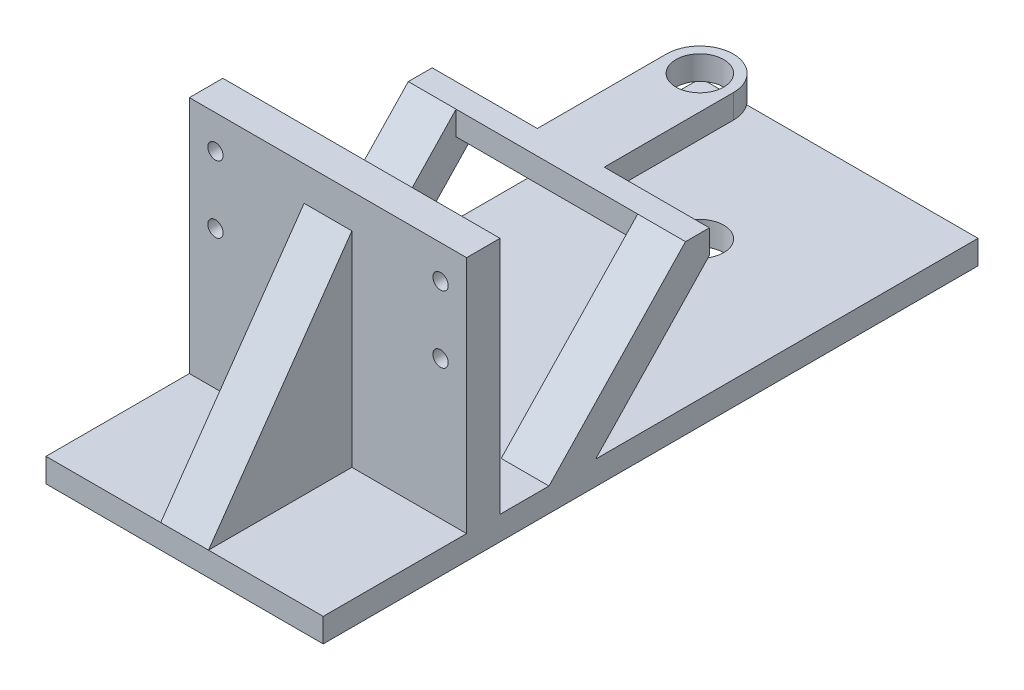
ISO-10303-21;
HEADER;
FILE_DESCRIPTION(('STEP AP214'),'2;1');
FILE_NAME('part.step','',(''),(''),'','','');
FILE_SCHEMA(('AUTOMOTIVE_DESIGN { 1 0 10303 214 1 1 1 1 }'));
ENDSEC;
DATA;
#1=APPLICATION_CONTEXT('core data for automotive mechanical design processes');
#2=APPLICATION_PROTOCOL_DEFINITION('international standard','automotive_design',2000,#1);
#3=PRODUCT_CONTEXT('',#1,'mechanical');
#4=PRODUCT('Part','Part','',(#3));
#5=PRODUCT_RELATED_PRODUCT_CATEGORY('part','',(#4));
#6=PRODUCT_DEFINITION_FORMATION('','',#4);
#7=PRODUCT_DEFINITION_CONTEXT('part definition',#1,'design');
#8=PRODUCT_DEFINITION('design','',#6,#7);
#9=PRODUCT_DEFINITION_SHAPE('','',#8);
#10=(LENGTH_UNIT() NAMED_UNIT(*) SI_UNIT(.MILLI.,.METRE.));
#11=(NAMED_UNIT(*) PLANE_ANGLE_UNIT() SI_UNIT($,.RADIAN.));
#12=(NAMED_UNIT(*) SI_UNIT($,.STERADIAN.) SOLID_ANGLE_UNIT());
#13=UNCERTAINTY_MEASURE_WITH_UNIT(LENGTH_MEASURE(1.E-05),#10,'distance_accuracy_value','');
#14=(GEOMETRIC_REPRESENTATION_CONTEXT(3) GLOBAL_UNCERTAINTY_ASSIGNED_CONTEXT((#13)) GLOBAL_UNIT_ASSIGNED_CONTEXT((#10,
#11,#12)) REPRESENTATION_CONTEXT('',''));
#15=CARTESIAN_POINT('',(0.,0.,0.));
#16=DIRECTION('',(0.,0.,1.));
#17=DIRECTION('',(1.,0.,0.));
#18=AXIS2_PLACEMENT_3D('',#15,#16,#17);
#19=CARTESIAN_POINT('',(8.89,9.525,-49.276));
#20=DIRECTION('',(-1.,0.,0.));
#21=DIRECTION('',(0.,0.,1.));
#22=AXIS2_PLACEMENT_3D('',#19,#20,#21);
#23=PLANE('',#22);
#24=DIRECTION('',(0.,-1.,0.));
#25=VECTOR('',#24,1.);
#26=CARTESIAN_POINT('',(8.89,9.525,-55.626));
#27=LINE('',#26,#25);
#28=CARTESIAN_POINT('',(8.89,9.525,-55.626));
#29=VERTEX_POINT('',#28);
#30=CARTESIAN_POINT('',(8.89,3.175,-55.626));
#31=VERTEX_POINT('',#30);
#32=EDGE_CURVE('E210',#29,#31,#27,.T.);
#33=ORIENTED_EDGE('',*,*,#32,.T.);
#34=DIRECTION('',(0.,0.,-1.));
#35=VECTOR('',#34,1.);
#36=CARTESIAN_POINT('',(8.89,3.175,-49.276));
#37=LINE('',#36,#35);
#38=CARTESIAN_POINT('',(8.88999999999999,3.175,-89.916));
#39=VERTEX_POINT('',#38);
#40=EDGE_CURVE('E276',#31,#39,#37,.T.);
#41=ORIENTED_EDGE('',*,*,#40,.T.);
#42=DIRECTION('',(0.,-1.,0.));
#43=VECTOR('',#42,1.);
#44=CARTESIAN_POINT('',(8.88999999999999,9.525,-89.916));
#45=LINE('',#44,#43);
#46=CARTESIAN_POINT('',(8.88999999999999,9.525,-89.916));
#47=VERTEX_POINT('',#46);
#48=EDGE_CURVE('E292',#47,#39,#45,.T.);
#49=ORIENTED_EDGE('',*,*,#48,.F.);
#50=DIRECTION('',(0.,0.,-1.));
#51=VECTOR('',#50,1.);
#52=CARTESIAN_POINT('',(8.89,9.525,-49.276));
#53=LINE('',#52,#51);
#54=EDGE_CURVE('E51',#29,#47,#53,.T.);
#55=ORIENTED_EDGE('',*,*,#54,.F.);
#56=EDGE_LOOP('',(#33,#41,#49,#55));
#57=FACE_BOUND('',#56,.T.);
#58=ADVANCED_FACE('F36',(#57),#23,.F.);
#59=CARTESIAN_POINT('',(36.83,-28.575,46.99));
#60=DIRECTION('',(0.,-1.,0.));
#61=DIRECTION('',(1.,0.,0.));
#62=AXIS2_PLACEMENT_3D('',#59,#60,#61);
#63=PLANE('',#62);
#64=DIRECTION('',(0.,0.,-1.));
#65=VECTOR('',#64,1.);
#66=CARTESIAN_POINT('',(6.35,-28.575,46.99));
#67=LINE('',#66,#65);
#68=CARTESIAN_POINT('',(6.35,-28.575,46.99));
#69=VERTEX_POINT('',#68);
#70=CARTESIAN_POINT('',(6.35,-28.575,8.89));
#71=VERTEX_POINT('',#70);
#72=EDGE_CURVE('E343',#69,#71,#67,.T.);
#73=ORIENTED_EDGE('',*,*,#72,.F.);
#74=DIRECTION('',(-1.,0.,0.));
#75=VECTOR('',#74,1.);
#76=CARTESIAN_POINT('',(36.83,-28.575,46.99));
#77=LINE('',#76,#75);
#78=CARTESIAN_POINT('',(36.83,-28.575,46.99));
#79=VERTEX_POINT('',#78);
#80=EDGE_CURVE('E366',#79,#69,#77,.T.);
#81=ORIENTED_EDGE('',*,*,#80,.F.);
#82=DIRECTION('',(0.,0.,-1.));
#83=VECTOR('',#82,1.);
#84=CARTESIAN_POINT('',(36.83,-28.575,46.99));
#85=LINE('',#84,#83);
#86=CARTESIAN_POINT('',(36.83,-28.575,8.89));
#87=VERTEX_POINT('',#86);
#88=EDGE_CURVE('E380',#79,#87,#85,.T.);
#89=ORIENTED_EDGE('',*,*,#88,.T.);
#90=DIRECTION('',(-1.,0.,0.));
#91=VECTOR('',#90,1.);
#92=CARTESIAN_POINT('',(36.83,-28.575,8.89));
#93=LINE('',#92,#91);
#94=EDGE_CURVE('E365',#87,#71,#93,.T.);
#95=ORIENTED_EDGE('',*,*,#94,.T.);
#96=EDGE_LOOP('',(#73,#81,#89,#95));
#97=FACE_BOUND('',#96,.T.);
#98=ADVANCED_FACE('F477',(#97),#63,.F.);
#99=CARTESIAN_POINT('',(0.,0.,0.));
#100=DIRECTION('',(0.,0.,1.));
#101=DIRECTION('',(1.,0.,0.));
#102=AXIS2_PLACEMENT_3D('',#99,#100,#101);
#103=PLANE('',#102);
#104=CARTESIAN_POINT('',(29.9085,26.035,0.));
#105=DIRECTION('',(0.,0.,-1.));
#106=DIRECTION('',(-1.,0.,0.));
#107=AXIS2_PLACEMENT_3D('',#104,#105,#106);
#108=CIRCLE('',#107,2.032);
#109=CARTESIAN_POINT('',(27.8765,26.035,0.));
#110=VERTEX_POINT('',#109);
#111=EDGE_CURVE('E410',#110,#110,#108,.T.);
#112=ORIENTED_EDGE('',*,*,#111,.F.);
#113=EDGE_LOOP('',(#112));
#114=FACE_BOUND('',#113,.T.);
#115=CARTESIAN_POINT('',(29.9085,8.255,0.));
#116=DIRECTION('',(0.,0.,-1.));
#117=DIRECTION('',(-1.,0.,0.));
#118=AXIS2_PLACEMENT_3D('',#115,#116,#117);
#119=CIRCLE('',#118,2.032);
#120=CARTESIAN_POINT('',(27.8765,8.255,0.));
#121=VERTEX_POINT('',#120);
#122=EDGE_CURVE('E403',#121,#121,#119,.T.);
#123=ORIENTED_EDGE('',*,*,#122,.F.);
#124=EDGE_LOOP('',(#123));
#125=FACE_BOUND('',#124,.T.);
#126=CARTESIAN_POINT('',(-29.9085,8.25500000000001,0.));
#127=DIRECTION('',(0.,0.,-1.));
#128=DIRECTION('',(1.,0.,0.));
#129=AXIS2_PLACEMENT_3D('',#126,#127,#128);
#130=CIRCLE('',#129,2.032);
#131=CARTESIAN_POINT('',(-27.8765,8.25500000000001,0.));
#132=VERTEX_POINT('',#131);
#133=EDGE_CURVE('E411',#132,#132,#130,.T.);
#134=ORIENTED_EDGE('',*,*,#133,.F.);
#135=EDGE_LOOP('',(#134));
#136=FACE_BOUND('',#135,.T.);
#137=CARTESIAN_POINT('',(-29.9085,26.035,0.));
#138=DIRECTION('',(0.,0.,-1.));
#139=DIRECTION('',(1.,0.,0.));
#140=AXIS2_PLACEMENT_3D('',#137,#138,#139);
#141=CIRCLE('',#140,2.03200000000001);
#142=CARTESIAN_POINT('',(-27.8765,26.035,0.));
#143=VERTEX_POINT('',#142);
#144=EDGE_CURVE('E402',#143,#143,#141,.T.);
#145=ORIENTED_EDGE('',*,*,#144,.F.);
#146=EDGE_LOOP('',(#145));
#147=FACE_BOUND('',#146,.T.);
#148=DIRECTION('',(1.,0.,0.));
#149=VECTOR('',#148,1.);
#150=CARTESIAN_POINT('',(36.83,-28.575,0.));
#151=LINE('',#150,#149);
#152=CARTESIAN_POINT('',(-36.83,-28.575,0.));
#153=VERTEX_POINT('',#152);
#154=CARTESIAN_POINT('',(36.83,-28.575,0.));
#155=VERTEX_POINT('',#154);
#156=EDGE_CURVE('E383',#153,#155,#151,.T.);
#157=ORIENTED_EDGE('',*,*,#156,.F.);
#158=DIRECTION('',(0.,-1.,0.));
#159=VECTOR('',#158,1.);
#160=CARTESIAN_POINT('',(-36.83,34.925,0.));
#161=LINE('',#160,#159);
#162=CARTESIAN_POINT('',(-36.83,34.925,0.));
#163=VERTEX_POINT('',#162);
#164=EDGE_CURVE('E426',#163,#153,#161,.T.);
#165=ORIENTED_EDGE('',*,*,#164,.F.);
#166=DIRECTION('',(-1.,0.,0.));
#167=VECTOR('',#166,1.);
#168=CARTESIAN_POINT('',(-36.83,34.925,0.));
#169=LINE('',#168,#167);
#170=CARTESIAN_POINT('',(36.83,34.925,0.));
#171=VERTEX_POINT('',#170);
#172=EDGE_CURVE('E431',#171,#163,#169,.T.);
#173=ORIENTED_EDGE('',*,*,#172,.F.);
#174=DIRECTION('',(0.,1.,0.));
#175=VECTOR('',#174,1.);
#176=CARTESIAN_POINT('',(36.83,34.925,0.));
#177=LINE('',#176,#175);
#178=EDGE_CURVE('E438',#155,#171,#177,.T.);
#179=ORIENTED_EDGE('',*,*,#178,.F.);
#180=EDGE_LOOP('',(#157,#165,#173,#179));
#181=FACE_BOUND('',#180,.T.);
#182=ADVANCED_FACE('F482',(#114,#125,#136,#147,#181),#103,.F.);
#183=CARTESIAN_POINT('',(-36.83,34.925,8.89));
#184=DIRECTION('',(1.,0.,0.));
#185=DIRECTION('',(0.,0.,-1.));
#186=AXIS2_PLACEMENT_3D('',#183,#184,#185);
#187=PLANE('',#186);
#188=DIRECTION('',(0.,-1.,0.));
#189=VECTOR('',#188,1.);
#190=CARTESIAN_POINT('',(-36.83,9.525,-55.626));
#191=LINE('',#190,#189);
#192=CARTESIAN_POINT('',(-36.83,9.525,-55.626));
#193=VERTEX_POINT('',#192);
#194=CARTESIAN_POINT('',(-36.83,3.175,-55.626));
#195=VERTEX_POINT('',#194);
#196=EDGE_CURVE('E274',#193,#195,#191,.T.);
#197=ORIENTED_EDGE('',*,*,#196,.T.);
#198=DIRECTION('',(0.,-0.724275709819138,0.689510475747819));
#199=VECTOR('',#198,1.);
#200=CARTESIAN_POINT('',(-36.83,-28.575,-25.4));
#201=LINE('',#200,#199);
#202=CARTESIAN_POINT('',(-36.83,-28.575,-25.4));
#203=VERTEX_POINT('',#202);
#204=EDGE_CURVE('E299',#195,#203,#201,.T.);
#205=ORIENTED_EDGE('',*,*,#204,.T.);
#206=DIRECTION('',(0.,0.,1.));
#207=VECTOR('',#206,1.);
#208=CARTESIAN_POINT('',(-36.83,-28.575,-127.));
#209=LINE('',#208,#207);
#210=CARTESIAN_POINT('',(-36.83,-28.575,-127.));
#211=VERTEX_POINT('',#210);
#212=EDGE_CURVE('E400',#211,#203,#209,.T.);
#213=ORIENTED_EDGE('',*,*,#212,.F.);
#214=DIRECTION('',(0.,1.,0.));
#215=VECTOR('',#214,1.);
#216=CARTESIAN_POINT('',(-36.83,-34.925,-127.));
#217=LINE('',#216,#215);
#218=CARTESIAN_POINT('',(-36.83,-34.925,-127.));
#219=VERTEX_POINT('',#218);
#220=EDGE_CURVE('E390',#219,#211,#217,.T.);
#221=ORIENTED_EDGE('',*,*,#220,.F.);
#222=DIRECTION('',(0.,0.,-1.));
#223=VECTOR('',#222,1.);
#224=CARTESIAN_POINT('',(-36.83,-34.925,8.89));
#225=LINE('',#224,#223);
#226=CARTESIAN_POINT('',(-36.83,-34.925,46.99));
#227=VERTEX_POINT('',#226);
#228=EDGE_CURVE('E11',#227,#219,#225,.T.);
#229=ORIENTED_EDGE('',*,*,#228,.F.);
#230=DIRECTION('',(0.,-1.,0.));
#231=VECTOR('',#230,1.);
#232=CARTESIAN_POINT('',(-36.83,-34.925,46.99));
#233=LINE('',#232,#231);
#234=CARTESIAN_POINT('',(-36.83,-28.575,46.99));
#235=VERTEX_POINT('',#234);
#236=EDGE_CURVE('E369',#235,#227,#233,.T.);
#237=ORIENTED_EDGE('',*,*,#236,.F.);
#238=DIRECTION('',(0.,0.,-1.));
#239=VECTOR('',#238,1.);
#240=CARTESIAN_POINT('',(-36.83,-28.575,46.99));
#241=LINE('',#240,#239);
#242=CARTESIAN_POINT('',(-36.83,-28.575,8.89));
#243=VERTEX_POINT('',#242);
#244=EDGE_CURVE('E375',#235,#243,#241,.T.);
#245=ORIENTED_EDGE('',*,*,#244,.T.);
#246=DIRECTION('',(0.,-1.,0.));
#247=VECTOR('',#246,1.);
#248=CARTESIAN_POINT('',(-36.83,34.925,8.89));
#249=LINE('',#248,#247);
#250=CARTESIAN_POINT('',(-36.83,34.925,8.89));
#251=VERTEX_POINT('',#250);
#252=EDGE_CURVE('E427',#251,#243,#249,.T.);
#253=ORIENTED_EDGE('',*,*,#252,.F.);
#254=DIRECTION('',(0.,0.,-1.));
#255=VECTOR('',#254,1.);
#256=CARTESIAN_POINT('',(-36.83,34.925,8.89));
#257=LINE('',#256,#255);
#258=EDGE_CURVE('E435',#251,#163,#257,.T.);
#259=ORIENTED_EDGE('',*,*,#258,.T.);
#260=ORIENTED_EDGE('',*,*,#164,.T.);
#261=CARTESIAN_POINT('',(-36.83,-28.575,-13.0048));
#262=VERTEX_POINT('',#261);
#263=EDGE_CURVE('E399',#262,#153,#209,.T.);
#264=ORIENTED_EDGE('',*,*,#263,.F.);
#265=DIRECTION('',(0.,0.724275709819138,-0.689510475747819));
#266=VECTOR('',#265,1.);
#267=CARTESIAN_POINT('',(-36.83,9.525,-49.276));
#268=LINE('',#267,#266);
#269=CARTESIAN_POINT('',(-36.83,9.525,-49.276));
#270=VERTEX_POINT('',#269);
#271=EDGE_CURVE('E295',#262,#270,#268,.T.);
#272=ORIENTED_EDGE('',*,*,#271,.T.);
#273=DIRECTION('',(0.,0.,1.));
#274=VECTOR('',#273,1.);
#275=CARTESIAN_POINT('',(-36.83,9.525,-55.626));
#276=LINE('',#275,#274);
#277=EDGE_CURVE('E262',#193,#270,#276,.T.);
#278=ORIENTED_EDGE('',*,*,#277,.F.);
#279=EDGE_LOOP('',(#197,#205,#213,#221,#229,#237,#245,#253,#259,#260,#264,#272,#278));
#280=FACE_BOUND('',#279,.T.);
#281=ADVANCED_FACE('F38',(#280),#187,.F.);
#282=CARTESIAN_POINT('',(-36.83,-34.925,8.89));
#283=DIRECTION('',(0.,1.,0.));
#284=DIRECTION('',(0.,0.,1.));
#285=AXIS2_PLACEMENT_3D('',#282,#283,#284);
#286=PLANE('',#285);
#287=CARTESIAN_POINT('',(0.,-34.925,-26.416));
#288=DIRECTION('',(0.,1.,0.));
#289=DIRECTION('',(0.,0.,1.));
#290=AXIS2_PLACEMENT_3D('',#287,#288,#289);
#291=CIRCLE('',#290,2.54);
#292=CARTESIAN_POINT('',(0.,-34.925,-23.876));
#293=VERTEX_POINT('',#292);
#294=EDGE_CURVE('E330',#293,#293,#291,.F.);
#295=ORIENTED_EDGE('',*,*,#294,.F.);
#296=EDGE_LOOP('',(#295));
#297=FACE_BOUND('',#296,.T.);
#298=CARTESIAN_POINT('',(0.,-34.925,-89.916));
#299=DIRECTION('',(0.,1.,0.));
#300=DIRECTION('',(0.,0.,1.));
#301=AXIS2_PLACEMENT_3D('',#298,#299,#300);
#302=CIRCLE('',#301,6.34999999999999);
#303=CARTESIAN_POINT('',(0.,-34.925,-83.566));
#304=VERTEX_POINT('',#303);
#305=EDGE_CURVE('E331',#304,#304,#302,.F.);
#306=ORIENTED_EDGE('',*,*,#305,.F.);
#307=EDGE_LOOP('',(#306));
#308=FACE_BOUND('',#307,.T.);
#309=ORIENTED_EDGE('',*,*,#228,.T.);
#310=DIRECTION('',(-1.,0.,0.));
#311=VECTOR('',#310,1.);
#312=CARTESIAN_POINT('',(36.83,-34.925,-127.));
#313=LINE('',#312,#311);
#314=CARTESIAN_POINT('',(36.83,-34.925,-127.));
#315=VERTEX_POINT('',#314);
#316=EDGE_CURVE('E387',#315,#219,#313,.T.);
#317=ORIENTED_EDGE('',*,*,#316,.F.);
#318=DIRECTION('',(0.,0.,-1.));
#319=VECTOR('',#318,1.);
#320=CARTESIAN_POINT('',(36.83,-34.925,8.89));
#321=LINE('',#320,#319);
#322=CARTESIAN_POINT('',(36.83,-34.925,46.99));
#323=VERTEX_POINT('',#322);
#324=EDGE_CURVE('E44',#323,#315,#321,.T.);
#325=ORIENTED_EDGE('',*,*,#324,.F.);
#326=DIRECTION('',(1.,0.,0.));
#327=VECTOR('',#326,1.);
#328=CARTESIAN_POINT('',(36.83,-34.925,46.99));
#329=LINE('',#328,#327);
#330=EDGE_CURVE('E372',#227,#323,#329,.T.);
#331=ORIENTED_EDGE('',*,*,#330,.F.);
#332=EDGE_LOOP('',(#309,#317,#325,#331));
#333=FACE_BOUND('',#332,.T.);
#334=ADVANCED_FACE('F451',(#297,#308,#333),#286,.F.);
#335=CARTESIAN_POINT('',(36.83,34.925,8.89));
#336=DIRECTION('',(-1.,0.,0.));
#337=DIRECTION('',(0.,0.,1.));
#338=AXIS2_PLACEMENT_3D('',#335,#336,#337);
#339=PLANE('',#338);
#340=DIRECTION('',(0.,0.,-1.));
#341=VECTOR('',#340,1.);
#342=CARTESIAN_POINT('',(36.83,9.525,-55.626));
#343=LINE('',#342,#341);
#344=CARTESIAN_POINT('',(36.83,9.525,-49.276));
#345=VERTEX_POINT('',#344);
#346=CARTESIAN_POINT('',(36.83,9.525,-55.626));
#347=VERTEX_POINT('',#346);
#348=EDGE_CURVE('E212',#345,#347,#343,.T.);
#349=ORIENTED_EDGE('',*,*,#348,.F.);
#350=DIRECTION('',(0.,-0.724275709819138,0.689510475747819));
#351=VECTOR('',#350,1.);
#352=CARTESIAN_POINT('',(36.83,9.525,-49.276));
#353=LINE('',#352,#351);
#354=CARTESIAN_POINT('',(36.83,-28.575,-13.0048));
#355=VERTEX_POINT('',#354);
#356=EDGE_CURVE('E59',#345,#355,#353,.T.);
#357=ORIENTED_EDGE('',*,*,#356,.T.);
#358=DIRECTION('',(0.,0.,1.));
#359=VECTOR('',#358,1.);
#360=CARTESIAN_POINT('',(36.83,-28.575,-127.));
#361=LINE('',#360,#359);
#362=EDGE_CURVE('E394',#355,#155,#361,.T.);
#363=ORIENTED_EDGE('',*,*,#362,.T.);
#364=ORIENTED_EDGE('',*,*,#178,.T.);
#365=DIRECTION('',(0.,0.,-1.));
#366=VECTOR('',#365,1.);
#367=CARTESIAN_POINT('',(36.83,34.925,8.89));
#368=LINE('',#367,#366);
#369=CARTESIAN_POINT('',(36.83,34.925,8.89));
#370=VERTEX_POINT('',#369);
#371=EDGE_CURVE('E443',#370,#171,#368,.T.);
#372=ORIENTED_EDGE('',*,*,#371,.F.);
#373=DIRECTION('',(0.,1.,0.));
#374=VECTOR('',#373,1.);
#375=CARTESIAN_POINT('',(36.83,34.925,8.89));
#376=LINE('',#375,#374);
#377=EDGE_CURVE('E430',#87,#370,#376,.T.);
#378=ORIENTED_EDGE('',*,*,#377,.F.);
#379=ORIENTED_EDGE('',*,*,#88,.F.);
#380=DIRECTION('',(0.,1.,0.));
#381=VECTOR('',#380,1.);
#382=CARTESIAN_POINT('',(36.83,-34.925,46.99));
#383=LINE('',#382,#381);
#384=EDGE_CURVE('E361',#323,#79,#383,.T.);
#385=ORIENTED_EDGE('',*,*,#384,.F.);
#386=ORIENTED_EDGE('',*,*,#324,.T.);
#387=DIRECTION('',(0.,-1.,0.));
#388=VECTOR('',#387,1.);
#389=CARTESIAN_POINT('',(36.83,-34.925,-127.));
#390=LINE('',#389,#388);
#391=CARTESIAN_POINT('',(36.83,-28.575,-127.));
#392=VERTEX_POINT('',#391);
#393=EDGE_CURVE('E384',#392,#315,#390,.T.);
#394=ORIENTED_EDGE('',*,*,#393,.F.);
#395=CARTESIAN_POINT('',(36.83,-28.575,-25.4));
#396=VERTEX_POINT('',#395);
#397=EDGE_CURVE('E397',#392,#396,#361,.T.);
#398=ORIENTED_EDGE('',*,*,#397,.T.);
#399=DIRECTION('',(0.,0.724275709819138,-0.689510475747819));
#400=VECTOR('',#399,1.);
#401=CARTESIAN_POINT('',(36.83,-28.575,-25.4));
#402=LINE('',#401,#400);
#403=CARTESIAN_POINT('',(36.83,3.175,-55.626));
#404=VERTEX_POINT('',#403);
#405=EDGE_CURVE('E225',#396,#404,#402,.T.);
#406=ORIENTED_EDGE('',*,*,#405,.T.);
#407=DIRECTION('',(0.,-1.,0.));
#408=VECTOR('',#407,1.);
#409=CARTESIAN_POINT('',(36.83,9.525,-55.626));
#410=LINE('',#409,#408);
#411=EDGE_CURVE('E208',#347,#404,#410,.T.);
#412=ORIENTED_EDGE('',*,*,#411,.F.);
#413=EDGE_LOOP('',(#349,#357,#363,#364,#372,#378,#379,#385,#386,#394,#398,#406,#412));
#414=FACE_BOUND('',#413,.T.);
#415=ADVANCED_FACE('F223',(#414),#339,.F.);
#416=CARTESIAN_POINT('',(-36.83,34.925,8.89));
#417=DIRECTION('',(0.,-1.,0.));
#418=DIRECTION('',(0.,0.,-1.));
#419=AXIS2_PLACEMENT_3D('',#416,#417,#418);
#420=PLANE('',#419);
#421=ORIENTED_EDGE('',*,*,#172,.T.);
#422=ORIENTED_EDGE('',*,*,#258,.F.);
#423=DIRECTION('',(-1.,0.,0.));
#424=VECTOR('',#423,1.);
#425=CARTESIAN_POINT('',(-36.83,34.925,8.89));
#426=LINE('',#425,#424);
#427=EDGE_CURVE('E433',#370,#251,#426,.T.);
#428=ORIENTED_EDGE('',*,*,#427,.F.);
#429=ORIENTED_EDGE('',*,*,#371,.T.);
#430=EDGE_LOOP('',(#421,#422,#428,#429));
#431=FACE_BOUND('',#430,.T.);
#432=ADVANCED_FACE('F555',(#431),#420,.F.);
#433=CARTESIAN_POINT('',(0.,0.,8.89));
#434=DIRECTION('',(0.,0.,1.));
#435=DIRECTION('',(1.,0.,0.));
#436=AXIS2_PLACEMENT_3D('',#433,#434,#435);
#437=PLANE('',#436);
#438=DIRECTION('',(0.,1.,0.));
#439=VECTOR('',#438,1.);
#440=CARTESIAN_POINT('',(-6.35,-28.575,8.89));
#441=LINE('',#440,#439);
#442=CARTESIAN_POINT('',(-6.35,-28.575,8.89));
#443=VERTEX_POINT('',#442);
#444=CARTESIAN_POINT('',(-6.35,25.8374390568744,8.89));
#445=VERTEX_POINT('',#444);
#446=EDGE_CURVE('E339',#443,#445,#441,.T.);
#447=ORIENTED_EDGE('',*,*,#446,.T.);
#448=DIRECTION('',(1.,0.,0.));
#449=VECTOR('',#448,1.);
#450=CARTESIAN_POINT('',(-6.35,25.8374390568744,8.89));
#451=LINE('',#450,#449);
#452=CARTESIAN_POINT('',(6.35,25.8374390568744,8.89));
#453=VERTEX_POINT('',#452);
#454=EDGE_CURVE('E349',#445,#453,#451,.T.);
#455=ORIENTED_EDGE('',*,*,#454,.T.);
#456=DIRECTION('',(0.,1.,0.));
#457=VECTOR('',#456,1.);
#458=CARTESIAN_POINT('',(6.35,-28.575,8.89));
#459=LINE('',#458,#457);
#460=EDGE_CURVE('E334',#71,#453,#459,.T.);
#461=ORIENTED_EDGE('',*,*,#460,.F.);
#462=ORIENTED_EDGE('',*,*,#94,.F.);
#463=ORIENTED_EDGE('',*,*,#377,.T.);
#464=ORIENTED_EDGE('',*,*,#427,.T.);
#465=ORIENTED_EDGE('',*,*,#252,.T.);
#466=EDGE_CURVE('E358',#443,#243,#93,.T.);
#467=ORIENTED_EDGE('',*,*,#466,.F.);
#468=EDGE_LOOP('',(#447,#455,#461,#462,#463,#464,#465,#467));
#469=FACE_BOUND('',#468,.T.);
#470=CARTESIAN_POINT('',(-29.9085,26.035,8.89));
#471=DIRECTION('',(0.,0.,1.));
#472=DIRECTION('',(1.,0.,0.));
#473=AXIS2_PLACEMENT_3D('',#470,#471,#472);
#474=CIRCLE('',#473,2.03200000000001);
#475=CARTESIAN_POINT('',(-27.8765,26.035,8.89));
#476=VERTEX_POINT('',#475);
#477=EDGE_CURVE('E414',#476,#476,#474,.F.);
#478=ORIENTED_EDGE('',*,*,#477,.T.);
#479=EDGE_LOOP('',(#478));
#480=FACE_BOUND('',#479,.T.);
#481=CARTESIAN_POINT('',(-29.9085,8.25500000000001,8.89));
#482=DIRECTION('',(0.,0.,1.));
#483=DIRECTION('',(1.,0.,0.));
#484=AXIS2_PLACEMENT_3D('',#481,#482,#483);
#485=CIRCLE('',#484,2.032);
#486=CARTESIAN_POINT('',(-27.8765,8.25500000000001,8.89));
#487=VERTEX_POINT('',#486);
#488=EDGE_CURVE('E407',#487,#487,#485,.F.);
#489=ORIENTED_EDGE('',*,*,#488,.T.);
#490=EDGE_LOOP('',(#489));
#491=FACE_BOUND('',#490,.T.);
#492=CARTESIAN_POINT('',(29.9085,8.255,8.89));
#493=DIRECTION('',(0.,0.,1.));
#494=DIRECTION('',(1.,0.,0.));
#495=AXIS2_PLACEMENT_3D('',#492,#493,#494);
#496=CIRCLE('',#495,2.032);
#497=CARTESIAN_POINT('',(31.9405,8.255,8.89));
#498=VERTEX_POINT('',#497);
#499=EDGE_CURVE('E406',#498,#498,#496,.F.);
#500=ORIENTED_EDGE('',*,*,#499,.T.);
#501=EDGE_LOOP('',(#500));
#502=FACE_BOUND('',#501,.T.);
#503=CARTESIAN_POINT('',(29.9085,26.035,8.89));
#504=DIRECTION('',(0.,0.,1.));
#505=DIRECTION('',(1.,0.,0.));
#506=AXIS2_PLACEMENT_3D('',#503,#504,#505);
#507=CIRCLE('',#506,2.032);
#508=CARTESIAN_POINT('',(31.9405,26.035,8.89));
#509=VERTEX_POINT('',#508);
#510=EDGE_CURVE('E423',#509,#509,#507,.F.);
#511=ORIENTED_EDGE('',*,*,#510,.T.);
#512=EDGE_LOOP('',(#511));
#513=FACE_BOUND('',#512,.T.);
#514=ADVANCED_FACE('F551',(#469,#480,#491,#502,#513),#437,.T.);
#515=CARTESIAN_POINT('',(29.9085,26.035,14.6373639174843));
#516=DIRECTION('',(0.,0.,-1.));
#517=DIRECTION('',(-1.,0.,0.));
#518=AXIS2_PLACEMENT_3D('',#515,#516,#517);
#519=CYLINDRICAL_SURFACE('',#518,2.032);
#520=ORIENTED_EDGE('',*,*,#111,.T.);
#521=EDGE_LOOP('',(#520));
#522=FACE_BOUND('',#521,.T.);
#523=ORIENTED_EDGE('',*,*,#510,.F.);
#524=EDGE_LOOP('',(#523));
#525=FACE_BOUND('',#524,.T.);
#526=ADVANCED_FACE('F541',(#522,#525),#519,.F.);
#527=CARTESIAN_POINT('',(29.9085,8.255,14.6373639174843));
#528=DIRECTION('',(0.,0.,-1.));
#529=DIRECTION('',(-1.,0.,0.));
#530=AXIS2_PLACEMENT_3D('',#527,#528,#529);
#531=CYLINDRICAL_SURFACE('',#530,2.032);
#532=ORIENTED_EDGE('',*,*,#122,.T.);
#533=EDGE_LOOP('',(#532));
#534=FACE_BOUND('',#533,.T.);
#535=ORIENTED_EDGE('',*,*,#499,.F.);
#536=EDGE_LOOP('',(#535));
#537=FACE_BOUND('',#536,.T.);
#538=ADVANCED_FACE('F537',(#534,#537),#531,.F.);
#539=CARTESIAN_POINT('',(-29.9085,8.25500000000001,14.6373639174843));
#540=DIRECTION('',(0.,0.,-1.));
#541=DIRECTION('',(-1.,0.,0.));
#542=AXIS2_PLACEMENT_3D('',#539,#540,#541);
#543=CYLINDRICAL_SURFACE('',#542,2.032);
#544=ORIENTED_EDGE('',*,*,#133,.T.);
#545=EDGE_LOOP('',(#544));
#546=FACE_BOUND('',#545,.T.);
#547=ORIENTED_EDGE('',*,*,#488,.F.);
#548=EDGE_LOOP('',(#547));
#549=FACE_BOUND('',#548,.T.);
#550=ADVANCED_FACE('F540',(#546,#549),#543,.F.);
#551=CARTESIAN_POINT('',(-29.9085,26.035,14.6373639174843));
#552=DIRECTION('',(0.,0.,-1.));
#553=DIRECTION('',(-1.,0.,0.));
#554=AXIS2_PLACEMENT_3D('',#551,#552,#553);
#555=CYLINDRICAL_SURFACE('',#554,2.03200000000001);
#556=ORIENTED_EDGE('',*,*,#144,.T.);
#557=EDGE_LOOP('',(#556));
#558=FACE_BOUND('',#557,.T.);
#559=ORIENTED_EDGE('',*,*,#477,.F.);
#560=EDGE_LOOP('',(#559));
#561=FACE_BOUND('',#560,.T.);
#562=ADVANCED_FACE('F536',(#558,#561),#555,.F.);
#563=CARTESIAN_POINT('',(36.83,-28.575,-127.));
#564=DIRECTION('',(0.,-1.,0.));
#565=DIRECTION('',(0.,0.,-1.));
#566=AXIS2_PLACEMENT_3D('',#563,#564,#565);
#567=PLANE('',#566);
#568=ORIENTED_EDGE('',*,*,#362,.F.);
#569=DIRECTION('',(1.,0.,0.));
#570=VECTOR('',#569,1.);
#571=CARTESIAN_POINT('',(24.13,-28.575,-13.0048));
#572=LINE('',#571,#570);
#573=CARTESIAN_POINT('',(24.13,-28.575,-13.0048));
#574=VERTEX_POINT('',#573);
#575=EDGE_CURVE('E248',#574,#355,#572,.T.);
#576=ORIENTED_EDGE('',*,*,#575,.F.);
#577=DIRECTION('',(0.,0.,-1.));
#578=VECTOR('',#577,1.);
#579=CARTESIAN_POINT('',(24.13,-28.575,-13.0048));
#580=LINE('',#579,#578);
#581=CARTESIAN_POINT('',(24.13,-28.575,-25.4));
#582=VERTEX_POINT('',#581);
#583=EDGE_CURVE('E231',#574,#582,#580,.T.);
#584=ORIENTED_EDGE('',*,*,#583,.T.);
#585=DIRECTION('',(1.,0.,0.));
#586=VECTOR('',#585,1.);
#587=CARTESIAN_POINT('',(24.13,-28.575,-25.4));
#588=LINE('',#587,#586);
#589=EDGE_CURVE('E245',#582,#396,#588,.T.);
#590=ORIENTED_EDGE('',*,*,#589,.T.);
#591=ORIENTED_EDGE('',*,*,#397,.F.);
#592=DIRECTION('',(1.,0.,0.));
#593=VECTOR('',#592,1.);
#594=CARTESIAN_POINT('',(36.83,-28.575,-127.));
#595=LINE('',#594,#593);
#596=EDGE_CURVE('E392',#211,#392,#595,.T.);
#597=ORIENTED_EDGE('',*,*,#596,.F.);
#598=ORIENTED_EDGE('',*,*,#212,.T.);
#599=DIRECTION('',(-1.,0.,0.));
#600=VECTOR('',#599,1.);
#601=CARTESIAN_POINT('',(-24.13,-28.575,-25.4));
#602=LINE('',#601,#600);
#603=CARTESIAN_POINT('',(-24.13,-28.575,-25.4));
#604=VERTEX_POINT('',#603);
#605=EDGE_CURVE('E316',#604,#203,#602,.T.);
#606=ORIENTED_EDGE('',*,*,#605,.F.);
#607=DIRECTION('',(0.,0.,1.));
#608=VECTOR('',#607,1.);
#609=CARTESIAN_POINT('',(-24.13,-28.575,-25.4));
#610=LINE('',#609,#608);
#611=CARTESIAN_POINT('',(-24.13,-28.575,-13.0048));
#612=VERTEX_POINT('',#611);
#613=EDGE_CURVE('E296',#604,#612,#610,.T.);
#614=ORIENTED_EDGE('',*,*,#613,.T.);
#615=DIRECTION('',(-1.,0.,0.));
#616=VECTOR('',#615,1.);
#617=CARTESIAN_POINT('',(-24.13,-28.575,-13.0048));
#618=LINE('',#617,#616);
#619=EDGE_CURVE('E311',#612,#262,#618,.T.);
#620=ORIENTED_EDGE('',*,*,#619,.T.);
#621=ORIENTED_EDGE('',*,*,#263,.T.);
#622=ORIENTED_EDGE('',*,*,#156,.T.);
#623=EDGE_LOOP('',(#568,#576,#584,#590,#591,#597,#598,#606,#614,#620,#621,#622));
#624=FACE_BOUND('',#623,.T.);
#625=CARTESIAN_POINT('',(0.,-28.575,-26.416));
#626=DIRECTION('',(0.,1.,0.));
#627=DIRECTION('',(0.,0.,1.));
#628=AXIS2_PLACEMENT_3D('',#625,#626,#627);
#629=CIRCLE('',#628,2.54);
#630=CARTESIAN_POINT('',(0.,-28.575,-23.876));
#631=VERTEX_POINT('',#630);
#632=EDGE_CURVE('E327',#631,#631,#629,.T.);
#633=ORIENTED_EDGE('',*,*,#632,.F.);
#634=EDGE_LOOP('',(#633));
#635=FACE_BOUND('',#634,.T.);
#636=CARTESIAN_POINT('',(0.,-28.575,-89.916));
#637=DIRECTION('',(0.,1.,0.));
#638=DIRECTION('',(0.,0.,1.));
#639=AXIS2_PLACEMENT_3D('',#636,#637,#638);
#640=CIRCLE('',#639,6.34999999999999);
#641=CARTESIAN_POINT('',(0.,-28.575,-83.566));
#642=VERTEX_POINT('',#641);
#643=EDGE_CURVE('E319',#642,#642,#640,.T.);
#644=ORIENTED_EDGE('',*,*,#643,.F.);
#645=EDGE_LOOP('',(#644));
#646=FACE_BOUND('',#645,.T.);
#647=ADVANCED_FACE('F460',(#624,#635,#646),#567,.F.);
#648=CARTESIAN_POINT('',(0.,0.,-127.));
#649=DIRECTION('',(0.,0.,1.));
#650=DIRECTION('',(1.,0.,0.));
#651=AXIS2_PLACEMENT_3D('',#648,#649,#650);
#652=PLANE('',#651);
#653=ORIENTED_EDGE('',*,*,#393,.T.);
#654=ORIENTED_EDGE('',*,*,#316,.T.);
#655=ORIENTED_EDGE('',*,*,#220,.T.);
#656=ORIENTED_EDGE('',*,*,#596,.T.);
#657=EDGE_LOOP('',(#653,#654,#655,#656));
#658=FACE_BOUND('',#657,.T.);
#659=ADVANCED_FACE('F454',(#658),#652,.F.);
#660=CARTESIAN_POINT('',(-6.35,-28.575,46.99));
#661=VERTEX_POINT('',#660);
#662=EDGE_CURVE('E364',#661,#235,#77,.T.);
#663=ORIENTED_EDGE('',*,*,#662,.F.);
#664=DIRECTION('',(0.,0.,-1.));
#665=VECTOR('',#664,1.);
#666=CARTESIAN_POINT('',(-6.35,-28.575,46.99));
#667=LINE('',#666,#665);
#668=EDGE_CURVE('E346',#661,#443,#667,.T.);
#669=ORIENTED_EDGE('',*,*,#668,.T.);
#670=ORIENTED_EDGE('',*,*,#466,.T.);
#671=ORIENTED_EDGE('',*,*,#244,.F.);
#672=EDGE_LOOP('',(#663,#669,#670,#671));
#673=FACE_BOUND('',#672,.T.);
#674=ADVANCED_FACE('F485',(#673),#63,.F.);
#675=CARTESIAN_POINT('',(0.,0.,46.99));
#676=DIRECTION('',(0.,0.,1.));
#677=DIRECTION('',(1.,0.,0.));
#678=AXIS2_PLACEMENT_3D('',#675,#676,#677);
#679=PLANE('',#678);
#680=ORIENTED_EDGE('',*,*,#384,.T.);
#681=ORIENTED_EDGE('',*,*,#80,.T.);
#682=DIRECTION('',(1.,0.,0.));
#683=VECTOR('',#682,1.);
#684=CARTESIAN_POINT('',(-6.35,-28.575,46.99));
#685=LINE('',#684,#683);
#686=EDGE_CURVE('E356',#661,#69,#685,.T.);
#687=ORIENTED_EDGE('',*,*,#686,.F.);
#688=ORIENTED_EDGE('',*,*,#662,.T.);
#689=ORIENTED_EDGE('',*,*,#236,.T.);
#690=ORIENTED_EDGE('',*,*,#330,.T.);
#691=EDGE_LOOP('',(#680,#681,#687,#688,#689,#690));
#692=FACE_BOUND('',#691,.T.);
#693=ADVANCED_FACE('F525',(#692),#679,.T.);
#694=CARTESIAN_POINT('',(-6.35,-28.575,46.99));
#695=DIRECTION('',(0.,0.573576436351047,0.819152044288991));
#696=DIRECTION('',(0.,-0.819152044288991,0.573576436351047));
#697=AXIS2_PLACEMENT_3D('',#694,#695,#696);
#698=PLANE('',#697);
#699=DIRECTION('',(0.,-0.819152044288991,0.573576436351047));
#700=VECTOR('',#699,1.);
#701=CARTESIAN_POINT('',(6.35,-28.575,46.99));
#702=LINE('',#701,#700);
#703=EDGE_CURVE('E352',#453,#69,#702,.T.);
#704=ORIENTED_EDGE('',*,*,#703,.F.);
#705=ORIENTED_EDGE('',*,*,#454,.F.);
#706=DIRECTION('',(0.,-0.819152044288991,0.573576436351047));
#707=VECTOR('',#706,1.);
#708=CARTESIAN_POINT('',(-6.35,-28.575,46.99));
#709=LINE('',#708,#707);
#710=EDGE_CURVE('E342',#445,#661,#709,.T.);
#711=ORIENTED_EDGE('',*,*,#710,.T.);
#712=ORIENTED_EDGE('',*,*,#686,.T.);
#713=EDGE_LOOP('',(#704,#705,#711,#712));
#714=FACE_BOUND('',#713,.T.);
#715=ADVANCED_FACE('F518',(#714),#698,.T.);
#716=CARTESIAN_POINT('',(-6.35,0.,0.));
#717=DIRECTION('',(-1.,0.,0.));
#718=DIRECTION('',(0.,0.,1.));
#719=AXIS2_PLACEMENT_3D('',#716,#717,#718);
#720=PLANE('',#719);
#721=ORIENTED_EDGE('',*,*,#446,.F.);
#722=ORIENTED_EDGE('',*,*,#668,.F.);
#723=ORIENTED_EDGE('',*,*,#710,.F.);
#724=EDGE_LOOP('',(#721,#722,#723));
#725=FACE_BOUND('',#724,.T.);
#726=ADVANCED_FACE('F515',(#725),#720,.T.);
#727=CARTESIAN_POINT('',(6.35,0.,0.));
#728=DIRECTION('',(-1.,0.,0.));
#729=DIRECTION('',(0.,0.,1.));
#730=AXIS2_PLACEMENT_3D('',#727,#728,#729);
#731=PLANE('',#730);
#732=ORIENTED_EDGE('',*,*,#460,.T.);
#733=ORIENTED_EDGE('',*,*,#703,.T.);
#734=ORIENTED_EDGE('',*,*,#72,.T.);
#735=EDGE_LOOP('',(#732,#733,#734));
#736=FACE_BOUND('',#735,.T.);
#737=ADVANCED_FACE('F513',(#736),#731,.F.);
#738=CARTESIAN_POINT('',(0.,-52.8855122421383,-89.916));
#739=DIRECTION('',(0.,1.,0.));
#740=DIRECTION('',(0.,0.,1.));
#741=AXIS2_PLACEMENT_3D('',#738,#739,#740);
#742=CYLINDRICAL_SURFACE('',#741,6.34999999999999);
#743=ORIENTED_EDGE('',*,*,#305,.T.);
#744=EDGE_LOOP('',(#743));
#745=FACE_BOUND('',#744,.T.);
#746=ORIENTED_EDGE('',*,*,#643,.T.);
#747=EDGE_LOOP('',(#746));
#748=FACE_BOUND('',#747,.T.);
#749=ADVANCED_FACE('F509',(#745,#748),#742,.F.);
#750=CARTESIAN_POINT('',(0.,-52.8855122421383,-26.416));
#751=DIRECTION('',(0.,1.,0.));
#752=DIRECTION('',(0.,0.,1.));
#753=AXIS2_PLACEMENT_3D('',#750,#751,#752);
#754=CYLINDRICAL_SURFACE('',#753,2.54);
#755=ORIENTED_EDGE('',*,*,#294,.T.);
#756=EDGE_LOOP('',(#755));
#757=FACE_BOUND('',#756,.T.);
#758=ORIENTED_EDGE('',*,*,#632,.T.);
#759=EDGE_LOOP('',(#758));
#760=FACE_BOUND('',#759,.T.);
#761=ADVANCED_FACE('F502',(#757,#760),#754,.F.);
#762=CARTESIAN_POINT('',(-24.13,-28.575,-25.4));
#763=DIRECTION('',(0.,-0.689510475747819,-0.724275709819138));
#764=DIRECTION('',(0.,0.724275709819138,-0.689510475747819));
#765=AXIS2_PLACEMENT_3D('',#762,#763,#764);
#766=PLANE('',#765);
#767=ORIENTED_EDGE('',*,*,#204,.F.);
#768=DIRECTION('',(-1.,0.,0.));
#769=VECTOR('',#768,1.);
#770=CARTESIAN_POINT('',(-24.13,3.175,-55.626));
#771=LINE('',#770,#769);
#772=CARTESIAN_POINT('',(-24.13,3.175,-55.626));
#773=VERTEX_POINT('',#772);
#774=EDGE_CURVE('E320',#773,#195,#771,.T.);
#775=ORIENTED_EDGE('',*,*,#774,.F.);
#776=DIRECTION('',(0.,-0.724275709819138,0.689510475747819));
#777=VECTOR('',#776,1.);
#778=CARTESIAN_POINT('',(-24.13,-28.575,-25.4));
#779=LINE('',#778,#777);
#780=EDGE_CURVE('E308',#773,#604,#779,.T.);
#781=ORIENTED_EDGE('',*,*,#780,.T.);
#782=ORIENTED_EDGE('',*,*,#605,.T.);
#783=EDGE_LOOP('',(#767,#775,#781,#782));
#784=FACE_BOUND('',#783,.T.);
#785=ADVANCED_FACE('F499',(#784),#766,.T.);
#786=CARTESIAN_POINT('',(-24.13,9.525,-49.276));
#787=DIRECTION('',(0.,0.689510475747819,0.724275709819138));
#788=DIRECTION('',(0.,-0.724275709819138,0.689510475747819));
#789=AXIS2_PLACEMENT_3D('',#786,#787,#788);
#790=PLANE('',#789);
#791=ORIENTED_EDGE('',*,*,#271,.F.);
#792=ORIENTED_EDGE('',*,*,#619,.F.);
#793=DIRECTION('',(0.,0.724275709819138,-0.689510475747819));
#794=VECTOR('',#793,1.);
#795=CARTESIAN_POINT('',(-24.13,9.525,-49.276));
#796=LINE('',#795,#794);
#797=CARTESIAN_POINT('',(-24.13,9.525,-49.276));
#798=VERTEX_POINT('',#797);
#799=EDGE_CURVE('E298',#612,#798,#796,.T.);
#800=ORIENTED_EDGE('',*,*,#799,.T.);
#801=DIRECTION('',(-1.,0.,0.));
#802=VECTOR('',#801,1.);
#803=CARTESIAN_POINT('',(-24.13,9.525,-49.276));
#804=LINE('',#803,#802);
#805=EDGE_CURVE('E323',#798,#270,#804,.T.);
#806=ORIENTED_EDGE('',*,*,#805,.T.);
#807=EDGE_LOOP('',(#791,#792,#800,#806));
#808=FACE_BOUND('',#807,.T.);
#809=ADVANCED_FACE('F497',(#808),#790,.T.);
#810=CARTESIAN_POINT('',(-24.13,0.,0.));
#811=DIRECTION('',(-1.,0.,0.));
#812=DIRECTION('',(0.,0.,1.));
#813=AXIS2_PLACEMENT_3D('',#810,#811,#812);
#814=PLANE('',#813);
#815=ORIENTED_EDGE('',*,*,#613,.F.);
#816=ORIENTED_EDGE('',*,*,#780,.F.);
#817=DIRECTION('',(0.,0.,-1.));
#818=VECTOR('',#817,1.);
#819=CARTESIAN_POINT('',(-24.13,3.175,-55.626));
#820=LINE('',#819,#818);
#821=CARTESIAN_POINT('',(-24.13,3.175,-49.276));
#822=VERTEX_POINT('',#821);
#823=EDGE_CURVE('E305',#822,#773,#820,.T.);
#824=ORIENTED_EDGE('',*,*,#823,.F.);
#825=DIRECTION('',(0.,-1.,0.));
#826=VECTOR('',#825,1.);
#827=CARTESIAN_POINT('',(-24.13,3.175,-49.276));
#828=LINE('',#827,#826);
#829=EDGE_CURVE('E302',#798,#822,#828,.T.);
#830=ORIENTED_EDGE('',*,*,#829,.F.);
#831=ORIENTED_EDGE('',*,*,#799,.F.);
#832=EDGE_LOOP('',(#815,#816,#824,#830,#831));
#833=FACE_BOUND('',#832,.T.);
#834=ADVANCED_FACE('F494',(#833),#814,.F.);
#835=CARTESIAN_POINT('',(0.,3.175,-89.916));
#836=DIRECTION('',(0.,1.,0.));
#837=DIRECTION('',(0.,0.,1.));
#838=AXIS2_PLACEMENT_3D('',#835,#836,#837);
#839=PLANE('',#838);
#840=CARTESIAN_POINT('',(0.,3.175,-89.916));
#841=DIRECTION('',(0.,1.,0.));
#842=DIRECTION('',(0.,0.,1.));
#843=AXIS2_PLACEMENT_3D('',#840,#841,#842);
#844=CIRCLE('',#843,6.34999999999999);
#845=CARTESIAN_POINT('',(0.,3.175,-83.566));
#846=VERTEX_POINT('',#845);
#847=EDGE_CURVE('E250',#846,#846,#844,.T.);
#848=ORIENTED_EDGE('',*,*,#847,.T.);
#849=EDGE_LOOP('',(#848));
#850=FACE_BOUND('',#849,.T.);
#851=DIRECTION('',(1.,0.,0.));
#852=VECTOR('',#851,1.);
#853=CARTESIAN_POINT('',(-36.83,3.175,-49.276));
#854=LINE('',#853,#852);
#855=CARTESIAN_POINT('',(24.13,3.175,-49.276));
#856=VERTEX_POINT('',#855);
#857=EDGE_CURVE('E259',#822,#856,#854,.T.);
#858=ORIENTED_EDGE('',*,*,#857,.F.);
#859=ORIENTED_EDGE('',*,*,#823,.T.);
#860=DIRECTION('',(-1.,0.,0.));
#861=VECTOR('',#860,1.);
#862=CARTESIAN_POINT('',(-8.88999999999999,3.175,-55.626));
#863=LINE('',#862,#861);
#864=CARTESIAN_POINT('',(-8.88999999999999,3.175,-55.626));
#865=VERTEX_POINT('',#864);
#866=EDGE_CURVE('E265',#865,#773,#863,.T.);
#867=ORIENTED_EDGE('',*,*,#866,.F.);
#868=DIRECTION('',(0.,0.,1.));
#869=VECTOR('',#868,1.);
#870=CARTESIAN_POINT('',(-8.88999999999999,3.175,-89.916));
#871=LINE('',#870,#869);
#872=CARTESIAN_POINT('',(-8.88999999999999,3.175,-89.916));
#873=VERTEX_POINT('',#872);
#874=EDGE_CURVE('E280',#873,#865,#871,.T.);
#875=ORIENTED_EDGE('',*,*,#874,.F.);
#876=CARTESIAN_POINT('',(0.,3.175,-89.916));
#877=DIRECTION('',(0.,1.,0.));
#878=DIRECTION('',(0.,0.,1.));
#879=AXIS2_PLACEMENT_3D('',#876,#877,#878);
#880=CIRCLE('',#879,8.88999999999999);
#881=EDGE_CURVE('E278',#39,#873,#880,.T.);
#882=ORIENTED_EDGE('',*,*,#881,.F.);
#883=ORIENTED_EDGE('',*,*,#40,.F.);
#884=DIRECTION('',(-1.,0.,0.));
#885=VECTOR('',#884,1.);
#886=CARTESIAN_POINT('',(36.83,3.175,-55.626));
#887=LINE('',#886,#885);
#888=CARTESIAN_POINT('',(24.13,3.175,-55.626));
#889=VERTEX_POINT('',#888);
#890=EDGE_CURVE('E220',#889,#31,#887,.T.);
#891=ORIENTED_EDGE('',*,*,#890,.F.);
#892=DIRECTION('',(0.,0.,1.));
#893=VECTOR('',#892,1.);
#894=CARTESIAN_POINT('',(24.13,3.175,-55.626));
#895=LINE('',#894,#893);
#896=EDGE_CURVE('E237',#889,#856,#895,.T.);
#897=ORIENTED_EDGE('',*,*,#896,.T.);
#898=EDGE_LOOP('',(#858,#859,#867,#875,#882,#883,#891,#897));
#899=FACE_BOUND('',#898,.T.);
#900=ADVANCED_FACE('F473',(#850,#899),#839,.F.);
#901=CARTESIAN_POINT('',(-36.83,9.525,-49.276));
#902=DIRECTION('',(0.,0.,-1.));
#903=DIRECTION('',(0.,1.,0.));
#904=AXIS2_PLACEMENT_3D('',#901,#902,#903);
#905=PLANE('',#904);
#906=DIRECTION('',(1.,0.,0.));
#907=VECTOR('',#906,1.);
#908=CARTESIAN_POINT('',(-36.83,9.525,-49.276));
#909=LINE('',#908,#907);
#910=CARTESIAN_POINT('',(24.13,9.525,-49.276));
#911=VERTEX_POINT('',#910);
#912=EDGE_CURVE('E264',#798,#911,#909,.T.);
#913=ORIENTED_EDGE('',*,*,#912,.F.);
#914=ORIENTED_EDGE('',*,*,#829,.T.);
#915=ORIENTED_EDGE('',*,*,#857,.T.);
#916=DIRECTION('',(0.,1.,0.));
#917=VECTOR('',#916,1.);
#918=CARTESIAN_POINT('',(24.13,3.175,-49.276));
#919=LINE('',#918,#917);
#920=EDGE_CURVE('E240',#856,#911,#919,.T.);
#921=ORIENTED_EDGE('',*,*,#920,.T.);
#922=EDGE_LOOP('',(#913,#914,#915,#921));
#923=FACE_BOUND('',#922,.T.);
#924=ADVANCED_FACE('F490',(#923),#905,.F.);
#925=CARTESIAN_POINT('',(0.,9.525,-89.916));
#926=DIRECTION('',(0.,1.,0.));
#927=DIRECTION('',(0.,0.,1.));
#928=AXIS2_PLACEMENT_3D('',#925,#926,#927);
#929=PLANE('',#928);
#930=ORIENTED_EDGE('',*,*,#277,.T.);
#931=ORIENTED_EDGE('',*,*,#805,.F.);
#932=ORIENTED_EDGE('',*,*,#912,.T.);
#933=DIRECTION('',(1.,0.,0.));
#934=VECTOR('',#933,1.);
#935=CARTESIAN_POINT('',(24.13,9.525,-49.276));
#936=LINE('',#935,#934);
#937=EDGE_CURVE('E219',#911,#345,#936,.T.);
#938=ORIENTED_EDGE('',*,*,#937,.T.);
#939=ORIENTED_EDGE('',*,*,#348,.T.);
#940=DIRECTION('',(-1.,0.,0.));
#941=VECTOR('',#940,1.);
#942=CARTESIAN_POINT('',(36.83,9.525,-55.626));
#943=LINE('',#942,#941);
#944=EDGE_CURVE('E203',#347,#29,#943,.T.);
#945=ORIENTED_EDGE('',*,*,#944,.T.);
#946=ORIENTED_EDGE('',*,*,#54,.T.);
#947=CARTESIAN_POINT('',(0.,9.525,-89.916));
#948=DIRECTION('',(0.,1.,0.));
#949=DIRECTION('',(0.,0.,1.));
#950=AXIS2_PLACEMENT_3D('',#947,#948,#949);
#951=CIRCLE('',#950,8.88999999999999);
#952=CARTESIAN_POINT('',(-8.88999999999999,9.525,-89.916));
#953=VERTEX_POINT('',#952);
#954=EDGE_CURVE('E268',#47,#953,#951,.T.);
#955=ORIENTED_EDGE('',*,*,#954,.T.);
#956=DIRECTION('',(0.,0.,1.));
#957=VECTOR('',#956,1.);
#958=CARTESIAN_POINT('',(-8.88999999999999,9.525,-89.916));
#959=LINE('',#958,#957);
#960=CARTESIAN_POINT('',(-8.88999999999999,9.525,-55.626));
#961=VERTEX_POINT('',#960);
#962=EDGE_CURVE('E270',#953,#961,#959,.T.);
#963=ORIENTED_EDGE('',*,*,#962,.T.);
#964=DIRECTION('',(-1.,0.,0.));
#965=VECTOR('',#964,1.);
#966=CARTESIAN_POINT('',(-8.88999999999999,9.525,-55.626));
#967=LINE('',#966,#965);
#968=EDGE_CURVE('E272',#961,#193,#967,.T.);
#969=ORIENTED_EDGE('',*,*,#968,.T.);
#970=EDGE_LOOP('',(#930,#931,#932,#938,#939,#945,#946,#955,#963,#969));
#971=FACE_BOUND('',#970,.T.);
#972=CARTESIAN_POINT('',(0.,9.525,-89.916));
#973=DIRECTION('',(0.,1.,0.));
#974=DIRECTION('',(0.,0.,1.));
#975=AXIS2_PLACEMENT_3D('',#972,#973,#974);
#976=CIRCLE('',#975,6.34999999999999);
#977=CARTESIAN_POINT('',(0.,9.525,-83.566));
#978=VERTEX_POINT('',#977);
#979=EDGE_CURVE('E256',#978,#978,#976,.T.);
#980=ORIENTED_EDGE('',*,*,#979,.F.);
#981=EDGE_LOOP('',(#980));
#982=FACE_BOUND('',#981,.T.);
#983=ADVANCED_FACE('F216',(#971,#982),#929,.T.);
#984=CARTESIAN_POINT('',(0.,9.525,-89.916));
#985=DIRECTION('',(0.,-1.,0.));
#986=DIRECTION('',(0.,0.,-1.));
#987=AXIS2_PLACEMENT_3D('',#984,#985,#986);
#988=CYLINDRICAL_SURFACE('',#987,8.88999999999999);
#989=ORIENTED_EDGE('',*,*,#881,.T.);
#990=DIRECTION('',(0.,-1.,0.));
#991=VECTOR('',#990,1.);
#992=CARTESIAN_POINT('',(-8.88999999999999,9.525,-89.916));
#993=LINE('',#992,#991);
#994=EDGE_CURVE('E289',#953,#873,#993,.T.);
#995=ORIENTED_EDGE('',*,*,#994,.F.);
#996=ORIENTED_EDGE('',*,*,#954,.F.);
#997=ORIENTED_EDGE('',*,*,#48,.T.);
#998=EDGE_LOOP('',(#989,#995,#996,#997));
#999=FACE_BOUND('',#998,.T.);
#1000=ADVANCED_FACE('F488',(#999),#988,.T.);
#1001=CARTESIAN_POINT('',(-8.88999999999999,9.525,-89.916));
#1002=DIRECTION('',(1.,0.,0.));
#1003=DIRECTION('',(0.,0.,-1.));
#1004=AXIS2_PLACEMENT_3D('',#1001,#1002,#1003);
#1005=PLANE('',#1004);
#1006=ORIENTED_EDGE('',*,*,#874,.T.);
#1007=DIRECTION('',(0.,-1.,0.));
#1008=VECTOR('',#1007,1.);
#1009=CARTESIAN_POINT('',(-8.88999999999999,9.525,-55.626));
#1010=LINE('',#1009,#1008);
#1011=EDGE_CURVE('E286',#961,#865,#1010,.T.);
#1012=ORIENTED_EDGE('',*,*,#1011,.F.);
#1013=ORIENTED_EDGE('',*,*,#962,.F.);
#1014=ORIENTED_EDGE('',*,*,#994,.T.);
#1015=EDGE_LOOP('',(#1006,#1012,#1013,#1014));
#1016=FACE_BOUND('',#1015,.T.);
#1017=ADVANCED_FACE('F591',(#1016),#1005,.F.);
#1018=CARTESIAN_POINT('',(-8.88999999999999,9.525,-55.626));
#1019=DIRECTION('',(0.,0.,1.));
#1020=DIRECTION('',(1.,0.,0.));
#1021=AXIS2_PLACEMENT_3D('',#1018,#1019,#1020);
#1022=PLANE('',#1021);
#1023=ORIENTED_EDGE('',*,*,#866,.T.);
#1024=ORIENTED_EDGE('',*,*,#774,.T.);
#1025=ORIENTED_EDGE('',*,*,#196,.F.);
#1026=ORIENTED_EDGE('',*,*,#968,.F.);
#1027=ORIENTED_EDGE('',*,*,#1011,.T.);
#1028=EDGE_LOOP('',(#1023,#1024,#1025,#1026,#1027));
#1029=FACE_BOUND('',#1028,.T.);
#1030=ADVANCED_FACE('F584',(#1029),#1022,.F.);
#1031=CARTESIAN_POINT('',(0.,9.525,-89.916));
#1032=DIRECTION('',(0.,-1.,0.));
#1033=DIRECTION('',(0.,0.,-1.));
#1034=AXIS2_PLACEMENT_3D('',#1031,#1032,#1033);
#1035=CYLINDRICAL_SURFACE('',#1034,6.34999999999999);
#1036=ORIENTED_EDGE('',*,*,#979,.T.);
#1037=EDGE_LOOP('',(#1036));
#1038=FACE_BOUND('',#1037,.T.);
#1039=ORIENTED_EDGE('',*,*,#847,.F.);
#1040=EDGE_LOOP('',(#1039));
#1041=FACE_BOUND('',#1040,.T.);
#1042=ADVANCED_FACE('F622',(#1038,#1041),#1035,.F.);
#1043=CARTESIAN_POINT('',(24.13,9.525,-49.276));
#1044=DIRECTION('',(0.,0.689510475747819,0.724275709819138));
#1045=DIRECTION('',(0.,-0.724275709819138,0.689510475747819));
#1046=AXIS2_PLACEMENT_3D('',#1043,#1044,#1045);
#1047=PLANE('',#1046);
#1048=ORIENTED_EDGE('',*,*,#356,.F.);
#1049=ORIENTED_EDGE('',*,*,#937,.F.);
#1050=DIRECTION('',(0.,-0.724275709819138,0.689510475747819));
#1051=VECTOR('',#1050,1.);
#1052=CARTESIAN_POINT('',(24.13,9.525,-49.276));
#1053=LINE('',#1052,#1051);
#1054=EDGE_CURVE('E243',#911,#574,#1053,.T.);
#1055=ORIENTED_EDGE('',*,*,#1054,.T.);
#1056=ORIENTED_EDGE('',*,*,#575,.T.);
#1057=EDGE_LOOP('',(#1048,#1049,#1055,#1056));
#1058=FACE_BOUND('',#1057,.T.);
#1059=ADVANCED_FACE('F620',(#1058),#1047,.T.);
#1060=CARTESIAN_POINT('',(24.13,-28.575,-25.4));
#1061=DIRECTION('',(0.,-0.689510475747819,-0.724275709819138));
#1062=DIRECTION('',(0.,0.724275709819138,-0.689510475747819));
#1063=AXIS2_PLACEMENT_3D('',#1060,#1061,#1062);
#1064=PLANE('',#1063);
#1065=ORIENTED_EDGE('',*,*,#405,.F.);
#1066=ORIENTED_EDGE('',*,*,#589,.F.);
#1067=DIRECTION('',(0.,0.724275709819138,-0.689510475747819));
#1068=VECTOR('',#1067,1.);
#1069=CARTESIAN_POINT('',(24.13,-28.575,-25.4));
#1070=LINE('',#1069,#1068);
#1071=EDGE_CURVE('E234',#582,#889,#1070,.T.);
#1072=ORIENTED_EDGE('',*,*,#1071,.T.);
#1073=DIRECTION('',(1.,0.,0.));
#1074=VECTOR('',#1073,1.);
#1075=CARTESIAN_POINT('',(24.13,3.175,-55.626));
#1076=LINE('',#1075,#1074);
#1077=EDGE_CURVE('E252',#889,#404,#1076,.T.);
#1078=ORIENTED_EDGE('',*,*,#1077,.T.);
#1079=EDGE_LOOP('',(#1065,#1066,#1072,#1078));
#1080=FACE_BOUND('',#1079,.T.);
#1081=ADVANCED_FACE('F465',(#1080),#1064,.T.);
#1082=CARTESIAN_POINT('',(24.13,0.,0.));
#1083=DIRECTION('',(1.,0.,0.));
#1084=DIRECTION('',(0.,0.,-1.));
#1085=AXIS2_PLACEMENT_3D('',#1082,#1083,#1084);
#1086=PLANE('',#1085);
#1087=ORIENTED_EDGE('',*,*,#583,.F.);
#1088=ORIENTED_EDGE('',*,*,#1054,.F.);
#1089=ORIENTED_EDGE('',*,*,#920,.F.);
#1090=ORIENTED_EDGE('',*,*,#896,.F.);
#1091=ORIENTED_EDGE('',*,*,#1071,.F.);
#1092=EDGE_LOOP('',(#1087,#1088,#1089,#1090,#1091));
#1093=FACE_BOUND('',#1092,.T.);
#1094=ADVANCED_FACE('F468',(#1093),#1086,.F.);
#1095=CARTESIAN_POINT('',(36.83,9.525,-55.626));
#1096=DIRECTION('',(0.,0.,1.));
#1097=DIRECTION('',(1.,0.,0.));
#1098=AXIS2_PLACEMENT_3D('',#1095,#1096,#1097);
#1099=PLANE('',#1098);
#1100=ORIENTED_EDGE('',*,*,#1077,.F.);
#1101=ORIENTED_EDGE('',*,*,#890,.T.);
#1102=ORIENTED_EDGE('',*,*,#32,.F.);
#1103=ORIENTED_EDGE('',*,*,#944,.F.);
#1104=ORIENTED_EDGE('',*,*,#411,.T.);
#1105=EDGE_LOOP('',(#1100,#1101,#1102,#1103,#1104));
#1106=FACE_BOUND('',#1105,.T.);
#1107=ADVANCED_FACE('F206',(#1106),#1099,.F.);
#1108=CLOSED_SHELL('',(#58,#98,#182,#281,#334,#415,#432,#514,#526,#538,#550,#562,#647,#659,#674,
#693,#715,#726,#737,#749,#761,#785,#809,#834,#900,#924,#983,#1000,#1017,#1030,#1042,#1059,#1081,
#1094,#1107));
#1109=MANIFOLD_SOLID_BREP('B2',#1108);
#1110=ADVANCED_BREP_SHAPE_REPRESENTATION('',(#18,#1109),#14);
#1111=SHAPE_DEFINITION_REPRESENTATION(#9,#1110);
ENDSEC;
END-ISO-10303-21;
